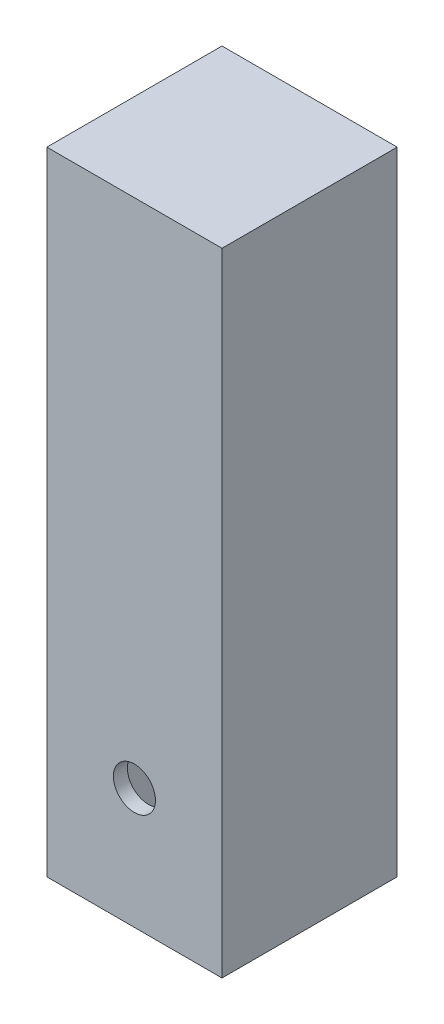
ISO-10303-21;
HEADER;
FILE_DESCRIPTION(('STEP AP214'),'2;1');
FILE_NAME('part.step','',(''),(''),'','','');
FILE_SCHEMA(('AUTOMOTIVE_DESIGN { 1 0 10303 214 1 1 1 1 }'));
ENDSEC;
DATA;
#1=APPLICATION_CONTEXT('core data for automotive mechanical design processes');
#2=APPLICATION_PROTOCOL_DEFINITION('international standard','automotive_design',2000,#1);
#3=PRODUCT_CONTEXT('',#1,'mechanical');
#4=PRODUCT('Part','Part','',(#3));
#5=PRODUCT_RELATED_PRODUCT_CATEGORY('part','',(#4));
#6=PRODUCT_DEFINITION_FORMATION('','',#4);
#7=PRODUCT_DEFINITION_CONTEXT('part definition',#1,'design');
#8=PRODUCT_DEFINITION('design','',#6,#7);
#9=PRODUCT_DEFINITION_SHAPE('','',#8);
#10=(LENGTH_UNIT() NAMED_UNIT(*) SI_UNIT(.MILLI.,.METRE.));
#11=(NAMED_UNIT(*) PLANE_ANGLE_UNIT() SI_UNIT($,.RADIAN.));
#12=(NAMED_UNIT(*) SI_UNIT($,.STERADIAN.) SOLID_ANGLE_UNIT());
#13=UNCERTAINTY_MEASURE_WITH_UNIT(LENGTH_MEASURE(1.E-05),#10,'distance_accuracy_value','');
#14=(GEOMETRIC_REPRESENTATION_CONTEXT(3) GLOBAL_UNCERTAINTY_ASSIGNED_CONTEXT((#13)) GLOBAL_UNIT_ASSIGNED_CONTEXT((#10,
#11,#12)) REPRESENTATION_CONTEXT('',''));
#15=CARTESIAN_POINT('',(0.,0.,0.));
#16=DIRECTION('',(0.,0.,1.));
#17=DIRECTION('',(1.,0.,0.));
#18=AXIS2_PLACEMENT_3D('',#15,#16,#17);
#19=CARTESIAN_POINT('',(-12.500000019,120.,-12.500000019));
#20=DIRECTION('',(1.,0.,0.));
#21=DIRECTION('',(0.,0.,-1.));
#22=AXIS2_PLACEMENT_3D('',#19,#20,#21);
#23=PLANE('',#22);
#24=DIRECTION('',(0.,0.,1.));
#25=VECTOR('',#24,1.);
#26=CARTESIAN_POINT('',(-12.500000019,29.7975454775425,-12.500000019));
#27=LINE('',#26,#25);
#28=CARTESIAN_POINT('',(-12.500000019,29.7975454775425,-12.500000019));
#29=VERTEX_POINT('',#28);
#30=CARTESIAN_POINT('',(-12.500000019,29.7975454775425,12.500000019));
#31=VERTEX_POINT('',#30);
#32=EDGE_CURVE('E154',#29,#31,#27,.T.);
#33=ORIENTED_EDGE('',*,*,#32,.T.);
#34=DIRECTION('',(0.,-1.,0.));
#35=VECTOR('',#34,1.);
#36=CARTESIAN_POINT('',(-12.500000019,120.,12.500000019));
#37=LINE('',#36,#35);
#38=CARTESIAN_POINT('',(-12.500000019,120.,12.500000019));
#39=VERTEX_POINT('',#38);
#40=EDGE_CURVE('E40',#39,#31,#37,.T.);
#41=ORIENTED_EDGE('',*,*,#40,.F.);
#42=DIRECTION('',(0.,0.,1.));
#43=VECTOR('',#42,1.);
#44=CARTESIAN_POINT('',(-12.500000019,120.,-12.500000019));
#45=LINE('',#44,#43);
#46=CARTESIAN_POINT('',(-12.500000019,120.,-12.500000019));
#47=VERTEX_POINT('',#46);
#48=EDGE_CURVE('E118',#47,#39,#45,.T.);
#49=ORIENTED_EDGE('',*,*,#48,.F.);
#50=DIRECTION('',(0.,-1.,0.));
#51=VECTOR('',#50,1.);
#52=CARTESIAN_POINT('',(-12.500000019,120.,-12.500000019));
#53=LINE('',#52,#51);
#54=EDGE_CURVE('E137',#47,#29,#53,.T.);
#55=ORIENTED_EDGE('',*,*,#54,.T.);
#56=EDGE_LOOP('',(#33,#41,#49,#55));
#57=FACE_BOUND('',#56,.T.);
#58=ADVANCED_FACE('F33',(#57),#23,.F.);
#59=CARTESIAN_POINT('',(-12.500000019,120.,12.500000019));
#60=DIRECTION('',(0.,0.,-1.));
#61=DIRECTION('',(-1.,0.,0.));
#62=AXIS2_PLACEMENT_3D('',#59,#60,#61);
#63=PLANE('',#62);
#64=CARTESIAN_POINT('',(0.,46.99999998,12.500000019));
#65=DIRECTION('',(0.,0.,1.));
#66=DIRECTION('',(1.,0.,0.));
#67=AXIS2_PLACEMENT_3D('',#64,#65,#66);
#68=CIRCLE('',#67,2.99999999999999);
#69=CARTESIAN_POINT('',(2.99999999999999,46.99999998,12.500000019));
#70=VERTEX_POINT('',#69);
#71=EDGE_CURVE('E157',#70,#70,#68,.T.);
#72=ORIENTED_EDGE('',*,*,#71,.F.);
#73=EDGE_LOOP('',(#72));
#74=FACE_BOUND('',#73,.T.);
#75=DIRECTION('',(-1.,0.,0.));
#76=VECTOR('',#75,1.);
#77=CARTESIAN_POINT('',(-12.500000019,29.7975454775425,12.500000019));
#78=LINE('',#77,#76);
#79=CARTESIAN_POINT('',(12.500000019,29.7975454775425,12.500000019));
#80=VERTEX_POINT('',#79);
#81=EDGE_CURVE('E104',#80,#31,#78,.T.);
#82=ORIENTED_EDGE('',*,*,#81,.F.);
#83=DIRECTION('',(0.,-1.,0.));
#84=VECTOR('',#83,1.);
#85=CARTESIAN_POINT('',(12.500000019,120.,12.500000019));
#86=LINE('',#85,#84);
#87=CARTESIAN_POINT('',(12.500000019,120.,12.500000019));
#88=VERTEX_POINT('',#87);
#89=EDGE_CURVE('E143',#88,#80,#86,.T.);
#90=ORIENTED_EDGE('',*,*,#89,.F.);
#91=DIRECTION('',(1.,0.,0.));
#92=VECTOR('',#91,1.);
#93=CARTESIAN_POINT('',(-12.500000019,120.,12.500000019));
#94=LINE('',#93,#92);
#95=EDGE_CURVE('E132',#39,#88,#94,.T.);
#96=ORIENTED_EDGE('',*,*,#95,.F.);
#97=ORIENTED_EDGE('',*,*,#40,.T.);
#98=EDGE_LOOP('',(#82,#90,#96,#97));
#99=FACE_BOUND('',#98,.T.);
#100=ADVANCED_FACE('F149',(#74,#99),#63,.F.);
#101=CARTESIAN_POINT('',(12.500000019,120.,-12.500000019));
#102=DIRECTION('',(-1.,0.,0.));
#103=DIRECTION('',(0.,0.,1.));
#104=AXIS2_PLACEMENT_3D('',#101,#102,#103);
#105=PLANE('',#104);
#106=ORIENTED_EDGE('',*,*,#89,.T.);
#107=DIRECTION('',(0.,0.,-1.));
#108=VECTOR('',#107,1.);
#109=CARTESIAN_POINT('',(12.500000019,29.7975454775425,-12.500000019));
#110=LINE('',#109,#108);
#111=CARTESIAN_POINT('',(12.500000019,29.7975454775425,-12.500000019));
#112=VERTEX_POINT('',#111);
#113=EDGE_CURVE('E158',#80,#112,#110,.T.);
#114=ORIENTED_EDGE('',*,*,#113,.T.);
#115=DIRECTION('',(0.,-1.,0.));
#116=VECTOR('',#115,1.);
#117=CARTESIAN_POINT('',(12.500000019,120.,-12.500000019));
#118=LINE('',#117,#116);
#119=CARTESIAN_POINT('',(12.500000019,120.,-12.500000019));
#120=VERTEX_POINT('',#119);
#121=EDGE_CURVE('E140',#120,#112,#118,.T.);
#122=ORIENTED_EDGE('',*,*,#121,.F.);
#123=DIRECTION('',(0.,0.,-1.));
#124=VECTOR('',#123,1.);
#125=CARTESIAN_POINT('',(12.500000019,120.,-12.500000019));
#126=LINE('',#125,#124);
#127=EDGE_CURVE('E134',#88,#120,#126,.T.);
#128=ORIENTED_EDGE('',*,*,#127,.F.);
#129=EDGE_LOOP('',(#106,#114,#122,#128));
#130=FACE_BOUND('',#129,.T.);
#131=ADVANCED_FACE('F208',(#130),#105,.F.);
#132=CARTESIAN_POINT('',(-10.500000019,120.,-12.500000019));
#133=DIRECTION('',(1.,0.,0.));
#134=DIRECTION('',(0.,0.,-1.));
#135=AXIS2_PLACEMENT_3D('',#132,#133,#134);
#136=PLANE('',#135);
#137=DIRECTION('',(0.,-1.,0.));
#138=VECTOR('',#137,1.);
#139=CARTESIAN_POINT('',(-10.500000019,120.,10.500000019));
#140=LINE('',#139,#138);
#141=CARTESIAN_POINT('',(-10.500000019,118.,10.500000019));
#142=VERTEX_POINT('',#141);
#143=CARTESIAN_POINT('',(-10.500000019,29.7975454775425,10.500000019));
#144=VERTEX_POINT('',#143);
#145=EDGE_CURVE('E116',#142,#144,#140,.T.);
#146=ORIENTED_EDGE('',*,*,#145,.T.);
#147=DIRECTION('',(0.,0.,1.));
#148=VECTOR('',#147,1.);
#149=CARTESIAN_POINT('',(-10.500000019,29.7975454775425,-12.500000019));
#150=LINE('',#149,#148);
#151=CARTESIAN_POINT('',(-10.500000019,29.7975454775425,-10.500000019));
#152=VERTEX_POINT('',#151);
#153=EDGE_CURVE('E103',#152,#144,#150,.T.);
#154=ORIENTED_EDGE('',*,*,#153,.F.);
#155=DIRECTION('',(0.,-1.,0.));
#156=VECTOR('',#155,1.);
#157=CARTESIAN_POINT('',(-10.500000019,120.,-10.500000019));
#158=LINE('',#157,#156);
#159=CARTESIAN_POINT('',(-10.500000019,118.,-10.500000019));
#160=VERTEX_POINT('',#159);
#161=EDGE_CURVE('E120',#160,#152,#158,.T.);
#162=ORIENTED_EDGE('',*,*,#161,.F.);
#163=DIRECTION('',(0.,0.,1.));
#164=VECTOR('',#163,1.);
#165=CARTESIAN_POINT('',(-10.500000019,118.,-12.500000019));
#166=LINE('',#165,#164);
#167=EDGE_CURVE('E126',#160,#142,#166,.T.);
#168=ORIENTED_EDGE('',*,*,#167,.T.);
#169=EDGE_LOOP('',(#146,#154,#162,#168));
#170=FACE_BOUND('',#169,.T.);
#171=ADVANCED_FACE('F181',(#170),#136,.T.);
#172=CARTESIAN_POINT('',(-12.500000019,120.,10.500000019));
#173=DIRECTION('',(0.,0.,-1.));
#174=DIRECTION('',(-1.,0.,0.));
#175=AXIS2_PLACEMENT_3D('',#172,#173,#174);
#176=PLANE('',#175);
#177=CARTESIAN_POINT('',(0.,46.99999998,10.500000019));
#178=DIRECTION('',(0.,0.,-1.));
#179=DIRECTION('',(-1.,0.,0.));
#180=AXIS2_PLACEMENT_3D('',#177,#178,#179);
#181=CIRCLE('',#180,2.99999999999998);
#182=CARTESIAN_POINT('',(-2.99999999999998,46.99999998,10.500000019));
#183=VERTEX_POINT('',#182);
#184=EDGE_CURVE('E175',#183,#183,#181,.T.);
#185=ORIENTED_EDGE('',*,*,#184,.F.);
#186=EDGE_LOOP('',(#185));
#187=FACE_BOUND('',#186,.T.);
#188=DIRECTION('',(0.,-1.,0.));
#189=VECTOR('',#188,1.);
#190=CARTESIAN_POINT('',(10.500000019,120.,10.500000019));
#191=LINE('',#190,#189);
#192=CARTESIAN_POINT('',(10.500000019,118.,10.500000019));
#193=VERTEX_POINT('',#192);
#194=CARTESIAN_POINT('',(10.500000019,29.7975454775425,10.500000019));
#195=VERTEX_POINT('',#194);
#196=EDGE_CURVE('E99',#193,#195,#191,.T.);
#197=ORIENTED_EDGE('',*,*,#196,.T.);
#198=DIRECTION('',(-1.,0.,0.));
#199=VECTOR('',#198,1.);
#200=CARTESIAN_POINT('',(-12.500000019,29.7975454775425,10.500000019));
#201=LINE('',#200,#199);
#202=EDGE_CURVE('E107',#195,#144,#201,.T.);
#203=ORIENTED_EDGE('',*,*,#202,.T.);
#204=ORIENTED_EDGE('',*,*,#145,.F.);
#205=DIRECTION('',(1.,0.,0.));
#206=VECTOR('',#205,1.);
#207=CARTESIAN_POINT('',(-12.500000019,118.,10.500000019));
#208=LINE('',#207,#206);
#209=EDGE_CURVE('E115',#142,#193,#208,.T.);
#210=ORIENTED_EDGE('',*,*,#209,.T.);
#211=EDGE_LOOP('',(#197,#203,#204,#210));
#212=FACE_BOUND('',#211,.T.);
#213=ADVANCED_FACE('F114',(#187,#212),#176,.T.);
#214=CARTESIAN_POINT('',(10.500000019,120.,-12.500000019));
#215=DIRECTION('',(-1.,0.,0.));
#216=DIRECTION('',(0.,0.,1.));
#217=AXIS2_PLACEMENT_3D('',#214,#215,#216);
#218=PLANE('',#217);
#219=DIRECTION('',(0.,0.,-1.));
#220=VECTOR('',#219,1.);
#221=CARTESIAN_POINT('',(10.500000019,29.7975454775425,-12.500000019));
#222=LINE('',#221,#220);
#223=CARTESIAN_POINT('',(10.500000019,29.7975454775425,-10.500000019));
#224=VERTEX_POINT('',#223);
#225=EDGE_CURVE('E46',#195,#224,#222,.T.);
#226=ORIENTED_EDGE('',*,*,#225,.F.);
#227=ORIENTED_EDGE('',*,*,#196,.F.);
#228=DIRECTION('',(0.,0.,-1.));
#229=VECTOR('',#228,1.);
#230=CARTESIAN_POINT('',(10.500000019,118.,-12.500000019));
#231=LINE('',#230,#229);
#232=CARTESIAN_POINT('',(10.500000019,118.,-10.500000019));
#233=VERTEX_POINT('',#232);
#234=EDGE_CURVE('E125',#193,#233,#231,.T.);
#235=ORIENTED_EDGE('',*,*,#234,.T.);
#236=DIRECTION('',(0.,-1.,0.));
#237=VECTOR('',#236,1.);
#238=CARTESIAN_POINT('',(10.500000019,120.,-10.500000019));
#239=LINE('',#238,#237);
#240=EDGE_CURVE('E102',#233,#224,#239,.T.);
#241=ORIENTED_EDGE('',*,*,#240,.T.);
#242=EDGE_LOOP('',(#226,#227,#235,#241));
#243=FACE_BOUND('',#242,.T.);
#244=ADVANCED_FACE('F97',(#243),#218,.T.);
#245=CARTESIAN_POINT('',(-12.500000019,120.,-12.500000019));
#246=DIRECTION('',(0.,0.,1.));
#247=DIRECTION('',(1.,0.,0.));
#248=AXIS2_PLACEMENT_3D('',#245,#246,#247);
#249=PLANE('',#248);
#250=CARTESIAN_POINT('',(0.,46.99999998,-12.500000019));
#251=DIRECTION('',(0.,0.,1.));
#252=DIRECTION('',(1.,0.,0.));
#253=AXIS2_PLACEMENT_3D('',#250,#251,#252);
#254=CIRCLE('',#253,2.99999999999997);
#255=CARTESIAN_POINT('',(2.99999999999997,46.99999998,-12.500000019));
#256=VERTEX_POINT('',#255);
#257=EDGE_CURVE('E169',#256,#256,#254,.T.);
#258=ORIENTED_EDGE('',*,*,#257,.T.);
#259=EDGE_LOOP('',(#258));
#260=FACE_BOUND('',#259,.T.);
#261=ORIENTED_EDGE('',*,*,#121,.T.);
#262=DIRECTION('',(-1.,0.,0.));
#263=VECTOR('',#262,1.);
#264=CARTESIAN_POINT('',(-12.500000019,29.7975454775425,-12.500000019));
#265=LINE('',#264,#263);
#266=EDGE_CURVE('E164',#112,#29,#265,.T.);
#267=ORIENTED_EDGE('',*,*,#266,.T.);
#268=ORIENTED_EDGE('',*,*,#54,.F.);
#269=DIRECTION('',(-1.,0.,0.));
#270=VECTOR('',#269,1.);
#271=CARTESIAN_POINT('',(-12.500000019,120.,-12.500000019));
#272=LINE('',#271,#270);
#273=EDGE_CURVE('E54',#120,#47,#272,.T.);
#274=ORIENTED_EDGE('',*,*,#273,.F.);
#275=EDGE_LOOP('',(#261,#267,#268,#274));
#276=FACE_BOUND('',#275,.T.);
#277=ADVANCED_FACE('F201',(#260,#276),#249,.F.);
#278=CARTESIAN_POINT('',(0.,120.,0.));
#279=DIRECTION('',(0.,1.,0.));
#280=DIRECTION('',(0.,0.,1.));
#281=AXIS2_PLACEMENT_3D('',#278,#279,#280);
#282=PLANE('',#281);
#283=ORIENTED_EDGE('',*,*,#48,.T.);
#284=ORIENTED_EDGE('',*,*,#95,.T.);
#285=ORIENTED_EDGE('',*,*,#127,.T.);
#286=ORIENTED_EDGE('',*,*,#273,.T.);
#287=EDGE_LOOP('',(#283,#284,#285,#286));
#288=FACE_BOUND('',#287,.T.);
#289=ADVANCED_FACE('F190',(#288),#282,.T.);
#290=CARTESIAN_POINT('',(-12.500000019,120.,-10.500000019));
#291=DIRECTION('',(0.,0.,1.));
#292=DIRECTION('',(1.,0.,0.));
#293=AXIS2_PLACEMENT_3D('',#290,#291,#292);
#294=PLANE('',#293);
#295=DIRECTION('',(-1.,0.,0.));
#296=VECTOR('',#295,1.);
#297=CARTESIAN_POINT('',(-12.500000019,29.7975454775425,-10.500000019));
#298=LINE('',#297,#296);
#299=EDGE_CURVE('E11',#224,#152,#298,.T.);
#300=ORIENTED_EDGE('',*,*,#299,.F.);
#301=ORIENTED_EDGE('',*,*,#240,.F.);
#302=DIRECTION('',(-1.,0.,0.));
#303=VECTOR('',#302,1.);
#304=CARTESIAN_POINT('',(-12.500000019,118.,-10.500000019));
#305=LINE('',#304,#303);
#306=EDGE_CURVE('E129',#233,#160,#305,.T.);
#307=ORIENTED_EDGE('',*,*,#306,.T.);
#308=ORIENTED_EDGE('',*,*,#161,.T.);
#309=EDGE_LOOP('',(#300,#301,#307,#308));
#310=FACE_BOUND('',#309,.T.);
#311=CARTESIAN_POINT('',(0.,46.99999998,-10.500000019));
#312=DIRECTION('',(0.,0.,1.));
#313=DIRECTION('',(1.,0.,0.));
#314=AXIS2_PLACEMENT_3D('',#311,#312,#313);
#315=CIRCLE('',#314,2.99999999999998);
#316=CARTESIAN_POINT('',(2.99999999999998,46.99999998,-10.500000019));
#317=VERTEX_POINT('',#316);
#318=EDGE_CURVE('E172',#317,#317,#315,.T.);
#319=ORIENTED_EDGE('',*,*,#318,.F.);
#320=EDGE_LOOP('',(#319));
#321=FACE_BOUND('',#320,.T.);
#322=ADVANCED_FACE('F187',(#310,#321),#294,.T.);
#323=CARTESIAN_POINT('',(0.,118.,0.));
#324=DIRECTION('',(0.,1.,0.));
#325=DIRECTION('',(0.,0.,1.));
#326=AXIS2_PLACEMENT_3D('',#323,#324,#325);
#327=PLANE('',#326);
#328=ORIENTED_EDGE('',*,*,#167,.F.);
#329=ORIENTED_EDGE('',*,*,#306,.F.);
#330=ORIENTED_EDGE('',*,*,#234,.F.);
#331=ORIENTED_EDGE('',*,*,#209,.F.);
#332=EDGE_LOOP('',(#328,#329,#330,#331));
#333=FACE_BOUND('',#332,.T.);
#334=ADVANCED_FACE('F185',(#333),#327,.F.);
#335=CARTESIAN_POINT('',(0.,46.99999998,12.500000019));
#336=DIRECTION('',(0.,0.,1.));
#337=DIRECTION('',(1.,0.,0.));
#338=AXIS2_PLACEMENT_3D('',#335,#336,#337);
#339=CYLINDRICAL_SURFACE('',#338,2.99999999999998);
#340=ORIENTED_EDGE('',*,*,#318,.T.);
#341=EDGE_LOOP('',(#340));
#342=FACE_BOUND('',#341,.T.);
#343=ORIENTED_EDGE('',*,*,#257,.F.);
#344=EDGE_LOOP('',(#343));
#345=FACE_BOUND('',#344,.T.);
#346=ADVANCED_FACE('F194',(#342,#345),#339,.F.);
#347=ORIENTED_EDGE('',*,*,#184,.T.);
#348=EDGE_LOOP('',(#347));
#349=FACE_BOUND('',#348,.T.);
#350=ORIENTED_EDGE('',*,*,#71,.T.);
#351=EDGE_LOOP('',(#350));
#352=FACE_BOUND('',#351,.T.);
#353=ADVANCED_FACE('F197',(#349,#352),#339,.F.);
#354=CARTESIAN_POINT('',(-16.1859063826171,29.7975454775425,-48.26));
#355=DIRECTION('',(0.,1.,0.));
#356=DIRECTION('',(0.,0.,1.));
#357=AXIS2_PLACEMENT_3D('',#354,#355,#356);
#358=PLANE('',#357);
#359=ORIENTED_EDGE('',*,*,#81,.T.);
#360=ORIENTED_EDGE('',*,*,#32,.F.);
#361=ORIENTED_EDGE('',*,*,#266,.F.);
#362=ORIENTED_EDGE('',*,*,#113,.F.);
#363=EDGE_LOOP('',(#359,#360,#361,#362));
#364=FACE_BOUND('',#363,.T.);
#365=ORIENTED_EDGE('',*,*,#153,.T.);
#366=ORIENTED_EDGE('',*,*,#202,.F.);
#367=ORIENTED_EDGE('',*,*,#225,.T.);
#368=ORIENTED_EDGE('',*,*,#299,.T.);
#369=EDGE_LOOP('',(#365,#366,#367,#368));
#370=FACE_BOUND('',#369,.T.);
#371=ADVANCED_FACE('F108',(#364,#370),#358,.F.);
#372=CLOSED_SHELL('',(#58,#100,#131,#171,#213,#244,#277,#289,#322,#334,#346,#353,#371));
#373=MANIFOLD_SOLID_BREP('B2',#372);
#374=ADVANCED_BREP_SHAPE_REPRESENTATION('',(#18,#373),#14);
#375=SHAPE_DEFINITION_REPRESENTATION(#9,#374);
ENDSEC;
END-ISO-10303-21;
